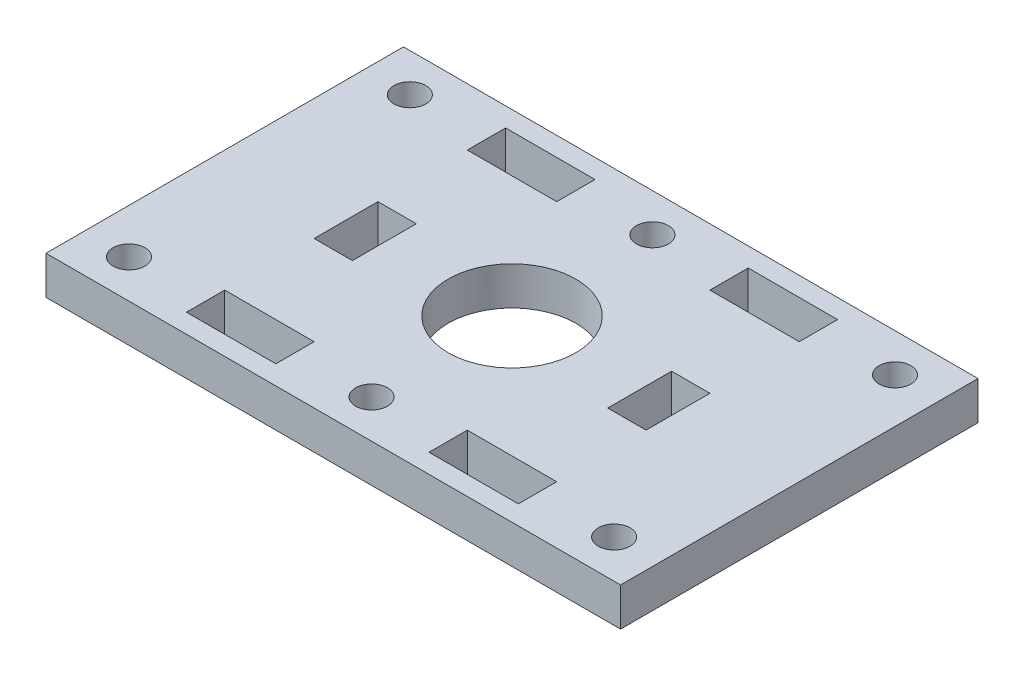
ISO-10303-21;
HEADER;
FILE_DESCRIPTION(('STEP AP214'),'2;1');
FILE_NAME('part.step','',(''),(''),'','','');
FILE_SCHEMA(('AUTOMOTIVE_DESIGN { 1 0 10303 214 1 1 1 1 }'));
ENDSEC;
DATA;
#1=APPLICATION_CONTEXT('core data for automotive mechanical design processes');
#2=APPLICATION_PROTOCOL_DEFINITION('international standard','automotive_design',2000,#1);
#3=PRODUCT_CONTEXT('',#1,'mechanical');
#4=PRODUCT('Part','Part','',(#3));
#5=PRODUCT_RELATED_PRODUCT_CATEGORY('part','',(#4));
#6=PRODUCT_DEFINITION_FORMATION('','',#4);
#7=PRODUCT_DEFINITION_CONTEXT('part definition',#1,'design');
#8=PRODUCT_DEFINITION('design','',#6,#7);
#9=PRODUCT_DEFINITION_SHAPE('','',#8);
#10=(LENGTH_UNIT() NAMED_UNIT(*) SI_UNIT(.MILLI.,.METRE.));
#11=(NAMED_UNIT(*) PLANE_ANGLE_UNIT() SI_UNIT($,.RADIAN.));
#12=(NAMED_UNIT(*) SI_UNIT($,.STERADIAN.) SOLID_ANGLE_UNIT());
#13=UNCERTAINTY_MEASURE_WITH_UNIT(LENGTH_MEASURE(1.E-05),#10,'distance_accuracy_value','');
#14=(GEOMETRIC_REPRESENTATION_CONTEXT(3) GLOBAL_UNCERTAINTY_ASSIGNED_CONTEXT((#13)) GLOBAL_UNIT_ASSIGNED_CONTEXT((#10,
#11,#12)) REPRESENTATION_CONTEXT('',''));
#15=CARTESIAN_POINT('',(0.,0.,0.));
#16=DIRECTION('',(0.,0.,1.));
#17=DIRECTION('',(1.,0.,0.));
#18=AXIS2_PLACEMENT_3D('',#15,#16,#17);
#19=CARTESIAN_POINT('',(0.,3.,0.));
#20=DIRECTION('',(1.,0.,0.));
#21=DIRECTION('',(0.,0.,-1.));
#22=AXIS2_PLACEMENT_3D('',#19,#20,#21);
#23=PLANE('',#22);
#24=DIRECTION('',(0.,0.,1.));
#25=VECTOR('',#24,1.);
#26=CARTESIAN_POINT('',(0.,0.,0.));
#27=LINE('',#26,#25);
#28=CARTESIAN_POINT('',(0.,0.,-28.));
#29=VERTEX_POINT('',#28);
#30=CARTESIAN_POINT('',(0.,0.,0.));
#31=VERTEX_POINT('',#30);
#32=EDGE_CURVE('E450',#29,#31,#27,.T.);
#33=ORIENTED_EDGE('',*,*,#32,.T.);
#34=DIRECTION('',(0.,-1.,0.));
#35=VECTOR('',#34,1.);
#36=CARTESIAN_POINT('',(0.,3.,0.));
#37=LINE('',#36,#35);
#38=CARTESIAN_POINT('',(0.,3.,0.));
#39=VERTEX_POINT('',#38);
#40=EDGE_CURVE('E11',#39,#31,#37,.T.);
#41=ORIENTED_EDGE('',*,*,#40,.F.);
#42=DIRECTION('',(0.,0.,1.));
#43=VECTOR('',#42,1.);
#44=CARTESIAN_POINT('',(0.,3.,0.));
#45=LINE('',#44,#43);
#46=CARTESIAN_POINT('',(0.,3.,-28.));
#47=VERTEX_POINT('',#46);
#48=EDGE_CURVE('E453',#47,#39,#45,.T.);
#49=ORIENTED_EDGE('',*,*,#48,.F.);
#50=DIRECTION('',(0.,-1.,0.));
#51=VECTOR('',#50,1.);
#52=CARTESIAN_POINT('',(0.,3.,-28.));
#53=LINE('',#52,#51);
#54=EDGE_CURVE('E463',#47,#29,#53,.T.);
#55=ORIENTED_EDGE('',*,*,#54,.T.);
#56=EDGE_LOOP('',(#33,#41,#49,#55));
#57=FACE_BOUND('',#56,.T.);
#58=ADVANCED_FACE('F32',(#57),#23,.F.);
#59=CARTESIAN_POINT('',(0.,3.,0.));
#60=DIRECTION('',(0.,0.,-1.));
#61=DIRECTION('',(-1.,0.,0.));
#62=AXIS2_PLACEMENT_3D('',#59,#60,#61);
#63=PLANE('',#62);
#64=DIRECTION('',(1.,0.,0.));
#65=VECTOR('',#64,1.);
#66=CARTESIAN_POINT('',(0.,0.,0.));
#67=LINE('',#66,#65);
#68=CARTESIAN_POINT('',(45.,0.,0.));
#69=VERTEX_POINT('',#68);
#70=EDGE_CURVE('E466',#31,#69,#67,.T.);
#71=ORIENTED_EDGE('',*,*,#70,.T.);
#72=DIRECTION('',(0.,-1.,0.));
#73=VECTOR('',#72,1.);
#74=CARTESIAN_POINT('',(45.,3.,0.));
#75=LINE('',#74,#73);
#76=CARTESIAN_POINT('',(45.,3.,0.));
#77=VERTEX_POINT('',#76);
#78=EDGE_CURVE('E40',#77,#69,#75,.T.);
#79=ORIENTED_EDGE('',*,*,#78,.F.);
#80=DIRECTION('',(1.,0.,0.));
#81=VECTOR('',#80,1.);
#82=CARTESIAN_POINT('',(0.,3.,0.));
#83=LINE('',#82,#81);
#84=EDGE_CURVE('E456',#39,#77,#83,.T.);
#85=ORIENTED_EDGE('',*,*,#84,.F.);
#86=ORIENTED_EDGE('',*,*,#40,.T.);
#87=EDGE_LOOP('',(#71,#79,#85,#86));
#88=FACE_BOUND('',#87,.T.);
#89=ADVANCED_FACE('F496',(#88),#63,.F.);
#90=CARTESIAN_POINT('',(45.,3.,0.));
#91=DIRECTION('',(-1.,0.,0.));
#92=DIRECTION('',(0.,0.,1.));
#93=AXIS2_PLACEMENT_3D('',#90,#91,#92);
#94=PLANE('',#93);
#95=DIRECTION('',(0.,0.,-1.));
#96=VECTOR('',#95,1.);
#97=CARTESIAN_POINT('',(45.,0.,0.));
#98=LINE('',#97,#96);
#99=CARTESIAN_POINT('',(45.,0.,-28.));
#100=VERTEX_POINT('',#99);
#101=EDGE_CURVE('E468',#69,#100,#98,.T.);
#102=ORIENTED_EDGE('',*,*,#101,.T.);
#103=DIRECTION('',(0.,-1.,0.));
#104=VECTOR('',#103,1.);
#105=CARTESIAN_POINT('',(45.,3.,-28.));
#106=LINE('',#105,#104);
#107=CARTESIAN_POINT('',(45.,3.,-28.));
#108=VERTEX_POINT('',#107);
#109=EDGE_CURVE('E473',#108,#100,#106,.T.);
#110=ORIENTED_EDGE('',*,*,#109,.F.);
#111=DIRECTION('',(0.,0.,-1.));
#112=VECTOR('',#111,1.);
#113=CARTESIAN_POINT('',(45.,3.,0.));
#114=LINE('',#113,#112);
#115=EDGE_CURVE('E459',#77,#108,#114,.T.);
#116=ORIENTED_EDGE('',*,*,#115,.F.);
#117=ORIENTED_EDGE('',*,*,#78,.T.);
#118=EDGE_LOOP('',(#102,#110,#116,#117));
#119=FACE_BOUND('',#118,.T.);
#120=ADVANCED_FACE('F481',(#119),#94,.F.);
#121=CARTESIAN_POINT('',(0.,3.,-28.));
#122=DIRECTION('',(0.,0.,1.));
#123=DIRECTION('',(1.,0.,0.));
#124=AXIS2_PLACEMENT_3D('',#121,#122,#123);
#125=PLANE('',#124);
#126=DIRECTION('',(-1.,0.,0.));
#127=VECTOR('',#126,1.);
#128=CARTESIAN_POINT('',(0.,0.,-28.));
#129=LINE('',#128,#127);
#130=EDGE_CURVE('E457',#100,#29,#129,.T.);
#131=ORIENTED_EDGE('',*,*,#130,.T.);
#132=ORIENTED_EDGE('',*,*,#54,.F.);
#133=DIRECTION('',(-1.,0.,0.));
#134=VECTOR('',#133,1.);
#135=CARTESIAN_POINT('',(0.,3.,-28.));
#136=LINE('',#135,#134);
#137=EDGE_CURVE('E461',#108,#47,#136,.T.);
#138=ORIENTED_EDGE('',*,*,#137,.F.);
#139=ORIENTED_EDGE('',*,*,#109,.T.);
#140=EDGE_LOOP('',(#131,#132,#138,#139));
#141=FACE_BOUND('',#140,.T.);
#142=ADVANCED_FACE('F489',(#141),#125,.F.);
#143=CARTESIAN_POINT('',(0.,3.,0.));
#144=DIRECTION('',(0.,-1.,0.));
#145=DIRECTION('',(0.,0.,-1.));
#146=AXIS2_PLACEMENT_3D('',#143,#144,#145);
#147=PLANE('',#146);
#148=CARTESIAN_POINT('',(22.5,3.,-14.));
#149=DIRECTION('',(0.,1.,0.));
#150=DIRECTION('',(0.,0.,1.));
#151=AXIS2_PLACEMENT_3D('',#148,#149,#150);
#152=CIRCLE('',#151,5.);
#153=CARTESIAN_POINT('',(22.5,3.,-9.));
#154=VERTEX_POINT('',#153);
#155=EDGE_CURVE('E244',#154,#154,#152,.T.);
#156=ORIENTED_EDGE('',*,*,#155,.F.);
#157=EDGE_LOOP('',(#156));
#158=FACE_BOUND('',#157,.T.);
#159=DIRECTION('',(1.,0.,0.));
#160=VECTOR('',#159,1.);
#161=CARTESIAN_POINT('',(9.49999999999999,3.,-11.5));
#162=LINE('',#161,#160);
#163=CARTESIAN_POINT('',(9.49999999999999,3.,-11.5));
#164=VERTEX_POINT('',#163);
#165=CARTESIAN_POINT('',(12.5,3.,-11.5));
#166=VERTEX_POINT('',#165);
#167=EDGE_CURVE('E249',#164,#166,#162,.T.);
#168=ORIENTED_EDGE('',*,*,#167,.F.);
#169=DIRECTION('',(0.,0.,1.));
#170=VECTOR('',#169,1.);
#171=CARTESIAN_POINT('',(9.49999999999999,3.,-11.5));
#172=LINE('',#171,#170);
#173=CARTESIAN_POINT('',(9.49999999999999,3.,-16.5));
#174=VERTEX_POINT('',#173);
#175=EDGE_CURVE('E47',#174,#164,#172,.T.);
#176=ORIENTED_EDGE('',*,*,#175,.F.);
#177=DIRECTION('',(-1.,0.,0.));
#178=VECTOR('',#177,1.);
#179=CARTESIAN_POINT('',(9.49999999999999,3.,-16.5));
#180=LINE('',#179,#178);
#181=CARTESIAN_POINT('',(12.5,3.,-16.5));
#182=VERTEX_POINT('',#181);
#183=EDGE_CURVE('E238',#182,#174,#180,.T.);
#184=ORIENTED_EDGE('',*,*,#183,.F.);
#185=DIRECTION('',(0.,0.,-1.));
#186=VECTOR('',#185,1.);
#187=CARTESIAN_POINT('',(12.5,3.,-11.5));
#188=LINE('',#187,#186);
#189=EDGE_CURVE('E241',#166,#182,#188,.T.);
#190=ORIENTED_EDGE('',*,*,#189,.F.);
#191=EDGE_LOOP('',(#168,#176,#184,#190));
#192=FACE_BOUND('',#191,.T.);
#193=DIRECTION('',(-1.,0.,0.));
#194=VECTOR('',#193,1.);
#195=CARTESIAN_POINT('',(35.5,3.,-16.5));
#196=LINE('',#195,#194);
#197=CARTESIAN_POINT('',(35.5,3.,-16.5));
#198=VERTEX_POINT('',#197);
#199=CARTESIAN_POINT('',(32.5,3.,-16.5));
#200=VERTEX_POINT('',#199);
#201=EDGE_CURVE('E275',#198,#200,#196,.T.);
#202=ORIENTED_EDGE('',*,*,#201,.F.);
#203=DIRECTION('',(0.,0.,-1.));
#204=VECTOR('',#203,1.);
#205=CARTESIAN_POINT('',(35.5,3.,-11.5));
#206=LINE('',#205,#204);
#207=CARTESIAN_POINT('',(35.5,3.,-11.5));
#208=VERTEX_POINT('',#207);
#209=EDGE_CURVE('E55',#208,#198,#206,.T.);
#210=ORIENTED_EDGE('',*,*,#209,.F.);
#211=DIRECTION('',(1.,0.,0.));
#212=VECTOR('',#211,1.);
#213=CARTESIAN_POINT('',(35.5,3.,-11.5));
#214=LINE('',#213,#212);
#215=CARTESIAN_POINT('',(32.5,3.,-11.5));
#216=VERTEX_POINT('',#215);
#217=EDGE_CURVE('E264',#216,#208,#214,.T.);
#218=ORIENTED_EDGE('',*,*,#217,.F.);
#219=DIRECTION('',(0.,0.,1.));
#220=VECTOR('',#219,1.);
#221=CARTESIAN_POINT('',(32.5,3.,-11.5));
#222=LINE('',#221,#220);
#223=EDGE_CURVE('E278',#200,#216,#222,.T.);
#224=ORIENTED_EDGE('',*,*,#223,.F.);
#225=EDGE_LOOP('',(#202,#210,#218,#224));
#226=FACE_BOUND('',#225,.T.);
#227=CARTESIAN_POINT('',(41.5,3.,-25.));
#228=DIRECTION('',(0.,1.,0.));
#229=DIRECTION('',(0.,0.,1.));
#230=AXIS2_PLACEMENT_3D('',#227,#228,#229);
#231=CIRCLE('',#230,1.25);
#232=CARTESIAN_POINT('',(41.5,3.,-23.75));
#233=VERTEX_POINT('',#232);
#234=EDGE_CURVE('E389',#233,#233,#231,.T.);
#235=ORIENTED_EDGE('',*,*,#234,.F.);
#236=EDGE_LOOP('',(#235));
#237=FACE_BOUND('',#236,.T.);
#238=CARTESIAN_POINT('',(3.49999999999999,3.,-25.));
#239=DIRECTION('',(0.,1.,0.));
#240=DIRECTION('',(0.,0.,-1.));
#241=AXIS2_PLACEMENT_3D('',#238,#239,#240);
#242=CIRCLE('',#241,1.25);
#243=CARTESIAN_POINT('',(3.49999999999999,3.,-26.25));
#244=VERTEX_POINT('',#243);
#245=EDGE_CURVE('E348',#244,#244,#242,.T.);
#246=ORIENTED_EDGE('',*,*,#245,.F.);
#247=EDGE_LOOP('',(#246));
#248=FACE_BOUND('',#247,.T.);
#249=DIRECTION('',(-1.,0.,0.));
#250=VECTOR('',#249,1.);
#251=CARTESIAN_POINT('',(35.5,3.,-4.5));
#252=LINE('',#251,#250);
#253=CARTESIAN_POINT('',(35.5,3.,-4.5));
#254=VERTEX_POINT('',#253);
#255=CARTESIAN_POINT('',(28.5,3.,-4.5));
#256=VERTEX_POINT('',#255);
#257=EDGE_CURVE('E337',#254,#256,#252,.T.);
#258=ORIENTED_EDGE('',*,*,#257,.F.);
#259=DIRECTION('',(0.,0.,-1.));
#260=VECTOR('',#259,1.);
#261=CARTESIAN_POINT('',(35.5,3.,-4.5));
#262=LINE('',#261,#260);
#263=CARTESIAN_POINT('',(35.5,3.,-1.5));
#264=VERTEX_POINT('',#263);
#265=EDGE_CURVE('E335',#264,#254,#262,.T.);
#266=ORIENTED_EDGE('',*,*,#265,.F.);
#267=DIRECTION('',(1.,0.,0.));
#268=VECTOR('',#267,1.);
#269=CARTESIAN_POINT('',(35.5,3.,-1.5));
#270=LINE('',#269,#268);
#271=CARTESIAN_POINT('',(28.5,3.,-1.5));
#272=VERTEX_POINT('',#271);
#273=EDGE_CURVE('E325',#272,#264,#270,.T.);
#274=ORIENTED_EDGE('',*,*,#273,.F.);
#275=DIRECTION('',(0.,0.,1.));
#276=VECTOR('',#275,1.);
#277=CARTESIAN_POINT('',(28.5,3.,-4.5));
#278=LINE('',#277,#276);
#279=EDGE_CURVE('E341',#256,#272,#278,.T.);
#280=ORIENTED_EDGE('',*,*,#279,.F.);
#281=EDGE_LOOP('',(#258,#266,#274,#280));
#282=FACE_BOUND('',#281,.T.);
#283=DIRECTION('',(0.,0.,-1.));
#284=VECTOR('',#283,1.);
#285=CARTESIAN_POINT('',(35.5,3.,-23.5));
#286=LINE('',#285,#284);
#287=CARTESIAN_POINT('',(35.5,3.,-23.5));
#288=VERTEX_POINT('',#287);
#289=CARTESIAN_POINT('',(35.5,3.,-26.5));
#290=VERTEX_POINT('',#289);
#291=EDGE_CURVE('E370',#288,#290,#286,.T.);
#292=ORIENTED_EDGE('',*,*,#291,.F.);
#293=DIRECTION('',(1.,0.,0.));
#294=VECTOR('',#293,1.);
#295=CARTESIAN_POINT('',(35.5,3.,-23.5));
#296=LINE('',#295,#294);
#297=CARTESIAN_POINT('',(28.5,3.,-23.5));
#298=VERTEX_POINT('',#297);
#299=EDGE_CURVE('E314',#298,#288,#296,.T.);
#300=ORIENTED_EDGE('',*,*,#299,.F.);
#301=DIRECTION('',(0.,0.,1.));
#302=VECTOR('',#301,1.);
#303=CARTESIAN_POINT('',(28.5,3.,-23.5));
#304=LINE('',#303,#302);
#305=CARTESIAN_POINT('',(28.5,3.,-26.5));
#306=VERTEX_POINT('',#305);
#307=EDGE_CURVE('E359',#306,#298,#304,.T.);
#308=ORIENTED_EDGE('',*,*,#307,.F.);
#309=DIRECTION('',(-1.,0.,0.));
#310=VECTOR('',#309,1.);
#311=CARTESIAN_POINT('',(35.5,3.,-26.5));
#312=LINE('',#311,#310);
#313=EDGE_CURVE('E373',#290,#306,#312,.T.);
#314=ORIENTED_EDGE('',*,*,#313,.F.);
#315=EDGE_LOOP('',(#292,#300,#308,#314));
#316=FACE_BOUND('',#315,.T.);
#317=CARTESIAN_POINT('',(22.5,3.,-25.));
#318=DIRECTION('',(0.,1.,0.));
#319=DIRECTION('',(0.,0.,-1.));
#320=AXIS2_PLACEMENT_3D('',#317,#318,#319);
#321=CIRCLE('',#320,1.25);
#322=CARTESIAN_POINT('',(22.5,3.,-26.25));
#323=VERTEX_POINT('',#322);
#324=EDGE_CURVE('E439',#323,#323,#321,.T.);
#325=ORIENTED_EDGE('',*,*,#324,.F.);
#326=EDGE_LOOP('',(#325));
#327=FACE_BOUND('',#326,.T.);
#328=CARTESIAN_POINT('',(3.5,3.,-3.));
#329=DIRECTION('',(0.,1.,0.));
#330=DIRECTION('',(0.,0.,1.));
#331=AXIS2_PLACEMENT_3D('',#328,#329,#330);
#332=CIRCLE('',#331,1.25);
#333=CARTESIAN_POINT('',(3.5,3.,-1.75));
#334=VERTEX_POINT('',#333);
#335=EDGE_CURVE('E400',#334,#334,#332,.T.);
#336=ORIENTED_EDGE('',*,*,#335,.F.);
#337=EDGE_LOOP('',(#336));
#338=FACE_BOUND('',#337,.T.);
#339=CARTESIAN_POINT('',(41.5,3.,-3.00000000000001));
#340=DIRECTION('',(0.,1.,0.));
#341=DIRECTION('',(0.,0.,-1.));
#342=AXIS2_PLACEMENT_3D('',#339,#340,#341);
#343=CIRCLE('',#342,1.25);
#344=CARTESIAN_POINT('',(41.5,3.,-4.25));
#345=VERTEX_POINT('',#344);
#346=EDGE_CURVE('E401',#345,#345,#343,.T.);
#347=ORIENTED_EDGE('',*,*,#346,.F.);
#348=EDGE_LOOP('',(#347));
#349=FACE_BOUND('',#348,.T.);
#350=DIRECTION('',(1.,0.,0.));
#351=VECTOR('',#350,1.);
#352=CARTESIAN_POINT('',(9.5,3.,-1.5));
#353=LINE('',#352,#351);
#354=CARTESIAN_POINT('',(9.5,3.,-1.5));
#355=VERTEX_POINT('',#354);
#356=CARTESIAN_POINT('',(16.5,3.,-1.5));
#357=VERTEX_POINT('',#356);
#358=EDGE_CURVE('E420',#355,#357,#353,.T.);
#359=ORIENTED_EDGE('',*,*,#358,.F.);
#360=DIRECTION('',(0.,0.,1.));
#361=VECTOR('',#360,1.);
#362=CARTESIAN_POINT('',(9.5,3.,-4.5));
#363=LINE('',#362,#361);
#364=CARTESIAN_POINT('',(9.5,3.,-4.5));
#365=VERTEX_POINT('',#364);
#366=EDGE_CURVE('E388',#365,#355,#363,.T.);
#367=ORIENTED_EDGE('',*,*,#366,.F.);
#368=DIRECTION('',(-1.,0.,0.));
#369=VECTOR('',#368,1.);
#370=CARTESIAN_POINT('',(9.5,3.,-4.5));
#371=LINE('',#370,#369);
#372=CARTESIAN_POINT('',(16.5,3.,-4.5));
#373=VERTEX_POINT('',#372);
#374=EDGE_CURVE('E409',#373,#365,#371,.T.);
#375=ORIENTED_EDGE('',*,*,#374,.F.);
#376=DIRECTION('',(0.,0.,-1.));
#377=VECTOR('',#376,1.);
#378=CARTESIAN_POINT('',(16.5,3.,-4.5));
#379=LINE('',#378,#377);
#380=EDGE_CURVE('E423',#357,#373,#379,.T.);
#381=ORIENTED_EDGE('',*,*,#380,.F.);
#382=EDGE_LOOP('',(#359,#367,#375,#381));
#383=FACE_BOUND('',#382,.T.);
#384=DIRECTION('',(1.,0.,0.));
#385=VECTOR('',#384,1.);
#386=CARTESIAN_POINT('',(9.49999999999999,3.,-23.5));
#387=LINE('',#386,#385);
#388=CARTESIAN_POINT('',(9.49999999999999,3.,-23.5));
#389=VERTEX_POINT('',#388);
#390=CARTESIAN_POINT('',(16.5,3.,-23.5));
#391=VERTEX_POINT('',#390);
#392=EDGE_CURVE('E304',#389,#391,#387,.T.);
#393=ORIENTED_EDGE('',*,*,#392,.F.);
#394=DIRECTION('',(0.,0.,1.));
#395=VECTOR('',#394,1.);
#396=CARTESIAN_POINT('',(9.49999999999999,3.,-23.5));
#397=LINE('',#396,#395);
#398=CARTESIAN_POINT('',(9.49999999999999,3.,-26.5));
#399=VERTEX_POINT('',#398);
#400=EDGE_CURVE('E256',#399,#389,#397,.T.);
#401=ORIENTED_EDGE('',*,*,#400,.F.);
#402=DIRECTION('',(-1.,0.,0.));
#403=VECTOR('',#402,1.);
#404=CARTESIAN_POINT('',(9.49999999999999,3.,-26.5));
#405=LINE('',#404,#403);
#406=CARTESIAN_POINT('',(16.5,3.,-26.5));
#407=VERTEX_POINT('',#406);
#408=EDGE_CURVE('E293',#407,#399,#405,.T.);
#409=ORIENTED_EDGE('',*,*,#408,.F.);
#410=DIRECTION('',(0.,0.,-1.));
#411=VECTOR('',#410,1.);
#412=CARTESIAN_POINT('',(16.5,3.,-23.5));
#413=LINE('',#412,#411);
#414=EDGE_CURVE('E307',#391,#407,#413,.T.);
#415=ORIENTED_EDGE('',*,*,#414,.F.);
#416=EDGE_LOOP('',(#393,#401,#409,#415));
#417=FACE_BOUND('',#416,.T.);
#418=CARTESIAN_POINT('',(22.5,3.,-3.00000000000001));
#419=DIRECTION('',(0.,1.,0.));
#420=DIRECTION('',(0.,0.,1.));
#421=AXIS2_PLACEMENT_3D('',#418,#419,#420);
#422=CIRCLE('',#421,1.25);
#423=CARTESIAN_POINT('',(22.5,3.,-1.75000000000001));
#424=VERTEX_POINT('',#423);
#425=EDGE_CURVE('E438',#424,#424,#422,.T.);
#426=ORIENTED_EDGE('',*,*,#425,.F.);
#427=EDGE_LOOP('',(#426));
#428=FACE_BOUND('',#427,.T.);
#429=ORIENTED_EDGE('',*,*,#48,.T.);
#430=ORIENTED_EDGE('',*,*,#84,.T.);
#431=ORIENTED_EDGE('',*,*,#115,.T.);
#432=ORIENTED_EDGE('',*,*,#137,.T.);
#433=EDGE_LOOP('',(#429,#430,#431,#432));
#434=FACE_BOUND('',#433,.T.);
#435=ADVANCED_FACE('F495',(#158,#192,#226,#237,#248,#282,#316,#327,#338,#349,#383,#417,#428,
#434),#147,.F.);
#436=CARTESIAN_POINT('',(0.,0.,0.));
#437=DIRECTION('',(0.,-1.,0.));
#438=DIRECTION('',(0.,0.,-1.));
#439=AXIS2_PLACEMENT_3D('',#436,#437,#438);
#440=PLANE('',#439);
#441=CARTESIAN_POINT('',(22.5,0.,-14.));
#442=DIRECTION('',(0.,-1.,0.));
#443=DIRECTION('',(0.,0.,-1.));
#444=AXIS2_PLACEMENT_3D('',#441,#442,#443);
#445=CIRCLE('',#444,5.);
#446=CARTESIAN_POINT('',(22.5,0.,-19.));
#447=VERTEX_POINT('',#446);
#448=EDGE_CURVE('E35',#447,#447,#445,.T.);
#449=ORIENTED_EDGE('',*,*,#448,.F.);
#450=EDGE_LOOP('',(#449));
#451=FACE_BOUND('',#450,.T.);
#452=DIRECTION('',(0.,0.,1.));
#453=VECTOR('',#452,1.);
#454=CARTESIAN_POINT('',(9.49999999999999,0.,-11.5));
#455=LINE('',#454,#453);
#456=CARTESIAN_POINT('',(9.49999999999999,0.,-16.5));
#457=VERTEX_POINT('',#456);
#458=CARTESIAN_POINT('',(9.49999999999999,0.,-11.5));
#459=VERTEX_POINT('',#458);
#460=EDGE_CURVE('E219',#457,#459,#455,.T.);
#461=ORIENTED_EDGE('',*,*,#460,.T.);
#462=DIRECTION('',(1.,0.,0.));
#463=VECTOR('',#462,1.);
#464=CARTESIAN_POINT('',(9.49999999999999,0.,-11.5));
#465=LINE('',#464,#463);
#466=CARTESIAN_POINT('',(12.5,0.,-11.5));
#467=VERTEX_POINT('',#466);
#468=EDGE_CURVE('E229',#459,#467,#465,.T.);
#469=ORIENTED_EDGE('',*,*,#468,.T.);
#470=DIRECTION('',(0.,0.,-1.));
#471=VECTOR('',#470,1.);
#472=CARTESIAN_POINT('',(12.5,0.,-11.5));
#473=LINE('',#472,#471);
#474=CARTESIAN_POINT('',(12.5,0.,-16.5));
#475=VERTEX_POINT('',#474);
#476=EDGE_CURVE('E233',#467,#475,#473,.T.);
#477=ORIENTED_EDGE('',*,*,#476,.T.);
#478=DIRECTION('',(-1.,0.,0.));
#479=VECTOR('',#478,1.);
#480=CARTESIAN_POINT('',(9.49999999999999,0.,-16.5));
#481=LINE('',#480,#479);
#482=EDGE_CURVE('E225',#475,#457,#481,.T.);
#483=ORIENTED_EDGE('',*,*,#482,.T.);
#484=EDGE_LOOP('',(#461,#469,#477,#483));
#485=FACE_BOUND('',#484,.T.);
#486=DIRECTION('',(0.,0.,-1.));
#487=VECTOR('',#486,1.);
#488=CARTESIAN_POINT('',(35.5,0.,-11.5));
#489=LINE('',#488,#487);
#490=CARTESIAN_POINT('',(35.5,0.,-11.5));
#491=VERTEX_POINT('',#490);
#492=CARTESIAN_POINT('',(35.5,0.,-16.5));
#493=VERTEX_POINT('',#492);
#494=EDGE_CURVE('E260',#491,#493,#489,.T.);
#495=ORIENTED_EDGE('',*,*,#494,.T.);
#496=DIRECTION('',(-1.,0.,0.));
#497=VECTOR('',#496,1.);
#498=CARTESIAN_POINT('',(35.5,0.,-16.5));
#499=LINE('',#498,#497);
#500=CARTESIAN_POINT('',(32.5,0.,-16.5));
#501=VERTEX_POINT('',#500);
#502=EDGE_CURVE('E263',#493,#501,#499,.T.);
#503=ORIENTED_EDGE('',*,*,#502,.T.);
#504=DIRECTION('',(0.,0.,1.));
#505=VECTOR('',#504,1.);
#506=CARTESIAN_POINT('',(32.5,0.,-11.5));
#507=LINE('',#506,#505);
#508=CARTESIAN_POINT('',(32.5,0.,-11.5));
#509=VERTEX_POINT('',#508);
#510=EDGE_CURVE('E267',#501,#509,#507,.T.);
#511=ORIENTED_EDGE('',*,*,#510,.T.);
#512=DIRECTION('',(1.,0.,0.));
#513=VECTOR('',#512,1.);
#514=CARTESIAN_POINT('',(35.5,0.,-11.5));
#515=LINE('',#514,#513);
#516=EDGE_CURVE('E270',#509,#491,#515,.T.);
#517=ORIENTED_EDGE('',*,*,#516,.T.);
#518=EDGE_LOOP('',(#495,#503,#511,#517));
#519=FACE_BOUND('',#518,.T.);
#520=CARTESIAN_POINT('',(41.5,0.,-25.));
#521=DIRECTION('',(0.,1.,0.));
#522=DIRECTION('',(0.,0.,1.));
#523=AXIS2_PLACEMENT_3D('',#520,#521,#522);
#524=CIRCLE('',#523,1.25);
#525=CARTESIAN_POINT('',(41.5,0.,-23.75));
#526=VERTEX_POINT('',#525);
#527=EDGE_CURVE('E385',#526,#526,#524,.T.);
#528=ORIENTED_EDGE('',*,*,#527,.T.);
#529=EDGE_LOOP('',(#528));
#530=FACE_BOUND('',#529,.T.);
#531=CARTESIAN_POINT('',(3.49999999999999,0.,-25.));
#532=DIRECTION('',(0.,1.,0.));
#533=DIRECTION('',(0.,0.,-1.));
#534=AXIS2_PLACEMENT_3D('',#531,#532,#533);
#535=CIRCLE('',#534,1.25);
#536=CARTESIAN_POINT('',(3.49999999999999,0.,-26.25));
#537=VERTEX_POINT('',#536);
#538=EDGE_CURVE('E392',#537,#537,#535,.T.);
#539=ORIENTED_EDGE('',*,*,#538,.T.);
#540=EDGE_LOOP('',(#539));
#541=FACE_BOUND('',#540,.T.);
#542=DIRECTION('',(0.,0.,-1.));
#543=VECTOR('',#542,1.);
#544=CARTESIAN_POINT('',(35.5,0.,-4.5));
#545=LINE('',#544,#543);
#546=CARTESIAN_POINT('',(35.5,0.,-1.5));
#547=VERTEX_POINT('',#546);
#548=CARTESIAN_POINT('',(35.5,0.,-4.5));
#549=VERTEX_POINT('',#548);
#550=EDGE_CURVE('E321',#547,#549,#545,.T.);
#551=ORIENTED_EDGE('',*,*,#550,.T.);
#552=DIRECTION('',(-1.,0.,0.));
#553=VECTOR('',#552,1.);
#554=CARTESIAN_POINT('',(35.5,0.,-4.5));
#555=LINE('',#554,#553);
#556=CARTESIAN_POINT('',(28.5,0.,-4.5));
#557=VERTEX_POINT('',#556);
#558=EDGE_CURVE('E324',#549,#557,#555,.T.);
#559=ORIENTED_EDGE('',*,*,#558,.T.);
#560=DIRECTION('',(0.,0.,1.));
#561=VECTOR('',#560,1.);
#562=CARTESIAN_POINT('',(28.5,0.,-4.5));
#563=LINE('',#562,#561);
#564=CARTESIAN_POINT('',(28.5,0.,-1.5));
#565=VERTEX_POINT('',#564);
#566=EDGE_CURVE('E328',#557,#565,#563,.T.);
#567=ORIENTED_EDGE('',*,*,#566,.T.);
#568=DIRECTION('',(1.,0.,0.));
#569=VECTOR('',#568,1.);
#570=CARTESIAN_POINT('',(35.5,0.,-1.5));
#571=LINE('',#570,#569);
#572=EDGE_CURVE('E331',#565,#547,#571,.T.);
#573=ORIENTED_EDGE('',*,*,#572,.T.);
#574=EDGE_LOOP('',(#551,#559,#567,#573));
#575=FACE_BOUND('',#574,.T.);
#576=DIRECTION('',(1.,0.,0.));
#577=VECTOR('',#576,1.);
#578=CARTESIAN_POINT('',(35.5,0.,-23.5));
#579=LINE('',#578,#577);
#580=CARTESIAN_POINT('',(28.5,0.,-23.5));
#581=VERTEX_POINT('',#580);
#582=CARTESIAN_POINT('',(35.5,0.,-23.5));
#583=VERTEX_POINT('',#582);
#584=EDGE_CURVE('E355',#581,#583,#579,.T.);
#585=ORIENTED_EDGE('',*,*,#584,.T.);
#586=DIRECTION('',(0.,0.,-1.));
#587=VECTOR('',#586,1.);
#588=CARTESIAN_POINT('',(35.5,0.,-23.5));
#589=LINE('',#588,#587);
#590=CARTESIAN_POINT('',(35.5,0.,-26.5));
#591=VERTEX_POINT('',#590);
#592=EDGE_CURVE('E358',#583,#591,#589,.T.);
#593=ORIENTED_EDGE('',*,*,#592,.T.);
#594=DIRECTION('',(-1.,0.,0.));
#595=VECTOR('',#594,1.);
#596=CARTESIAN_POINT('',(35.5,0.,-26.5));
#597=LINE('',#596,#595);
#598=CARTESIAN_POINT('',(28.5,0.,-26.5));
#599=VERTEX_POINT('',#598);
#600=EDGE_CURVE('E362',#591,#599,#597,.T.);
#601=ORIENTED_EDGE('',*,*,#600,.T.);
#602=DIRECTION('',(0.,0.,1.));
#603=VECTOR('',#602,1.);
#604=CARTESIAN_POINT('',(28.5,0.,-23.5));
#605=LINE('',#604,#603);
#606=EDGE_CURVE('E365',#599,#581,#605,.T.);
#607=ORIENTED_EDGE('',*,*,#606,.T.);
#608=EDGE_LOOP('',(#585,#593,#601,#607));
#609=FACE_BOUND('',#608,.T.);
#610=CARTESIAN_POINT('',(22.5,0.,-25.));
#611=DIRECTION('',(0.,1.,0.));
#612=DIRECTION('',(0.,0.,-1.));
#613=AXIS2_PLACEMENT_3D('',#610,#611,#612);
#614=CIRCLE('',#613,1.25);
#615=CARTESIAN_POINT('',(22.5,0.,-26.25));
#616=VERTEX_POINT('',#615);
#617=EDGE_CURVE('E435',#616,#616,#614,.T.);
#618=ORIENTED_EDGE('',*,*,#617,.T.);
#619=EDGE_LOOP('',(#618));
#620=FACE_BOUND('',#619,.T.);
#621=CARTESIAN_POINT('',(3.5,0.,-3.));
#622=DIRECTION('',(0.,1.,0.));
#623=DIRECTION('',(0.,0.,1.));
#624=AXIS2_PLACEMENT_3D('',#621,#622,#623);
#625=CIRCLE('',#624,1.25);
#626=CARTESIAN_POINT('',(3.5,0.,-1.75));
#627=VERTEX_POINT('',#626);
#628=EDGE_CURVE('E442',#627,#627,#625,.T.);
#629=ORIENTED_EDGE('',*,*,#628,.T.);
#630=EDGE_LOOP('',(#629));
#631=FACE_BOUND('',#630,.T.);
#632=CARTESIAN_POINT('',(41.5,0.,-3.00000000000001));
#633=DIRECTION('',(0.,1.,0.));
#634=DIRECTION('',(0.,0.,-1.));
#635=AXIS2_PLACEMENT_3D('',#632,#633,#634);
#636=CIRCLE('',#635,1.25);
#637=CARTESIAN_POINT('',(41.5,0.,-4.25));
#638=VERTEX_POINT('',#637);
#639=EDGE_CURVE('E397',#638,#638,#636,.T.);
#640=ORIENTED_EDGE('',*,*,#639,.T.);
#641=EDGE_LOOP('',(#640));
#642=FACE_BOUND('',#641,.T.);
#643=DIRECTION('',(0.,0.,1.));
#644=VECTOR('',#643,1.);
#645=CARTESIAN_POINT('',(9.5,0.,-4.5));
#646=LINE('',#645,#644);
#647=CARTESIAN_POINT('',(9.5,0.,-4.5));
#648=VERTEX_POINT('',#647);
#649=CARTESIAN_POINT('',(9.5,0.,-1.5));
#650=VERTEX_POINT('',#649);
#651=EDGE_CURVE('E405',#648,#650,#646,.T.);
#652=ORIENTED_EDGE('',*,*,#651,.T.);
#653=DIRECTION('',(1.,0.,0.));
#654=VECTOR('',#653,1.);
#655=CARTESIAN_POINT('',(9.5,0.,-1.5));
#656=LINE('',#655,#654);
#657=CARTESIAN_POINT('',(16.5,0.,-1.5));
#658=VERTEX_POINT('',#657);
#659=EDGE_CURVE('E408',#650,#658,#656,.T.);
#660=ORIENTED_EDGE('',*,*,#659,.T.);
#661=DIRECTION('',(0.,0.,-1.));
#662=VECTOR('',#661,1.);
#663=CARTESIAN_POINT('',(16.5,0.,-4.5));
#664=LINE('',#663,#662);
#665=CARTESIAN_POINT('',(16.5,0.,-4.5));
#666=VERTEX_POINT('',#665);
#667=EDGE_CURVE('E412',#658,#666,#664,.T.);
#668=ORIENTED_EDGE('',*,*,#667,.T.);
#669=DIRECTION('',(-1.,0.,0.));
#670=VECTOR('',#669,1.);
#671=CARTESIAN_POINT('',(9.5,0.,-4.5));
#672=LINE('',#671,#670);
#673=EDGE_CURVE('E415',#666,#648,#672,.T.);
#674=ORIENTED_EDGE('',*,*,#673,.T.);
#675=EDGE_LOOP('',(#652,#660,#668,#674));
#676=FACE_BOUND('',#675,.T.);
#677=DIRECTION('',(0.,0.,1.));
#678=VECTOR('',#677,1.);
#679=CARTESIAN_POINT('',(9.49999999999999,0.,-23.5));
#680=LINE('',#679,#678);
#681=CARTESIAN_POINT('',(9.49999999999999,0.,-26.5));
#682=VERTEX_POINT('',#681);
#683=CARTESIAN_POINT('',(9.49999999999999,0.,-23.5));
#684=VERTEX_POINT('',#683);
#685=EDGE_CURVE('E289',#682,#684,#680,.T.);
#686=ORIENTED_EDGE('',*,*,#685,.T.);
#687=DIRECTION('',(1.,0.,0.));
#688=VECTOR('',#687,1.);
#689=CARTESIAN_POINT('',(9.49999999999999,0.,-23.5));
#690=LINE('',#689,#688);
#691=CARTESIAN_POINT('',(16.5,0.,-23.5));
#692=VERTEX_POINT('',#691);
#693=EDGE_CURVE('E292',#684,#692,#690,.T.);
#694=ORIENTED_EDGE('',*,*,#693,.T.);
#695=DIRECTION('',(0.,0.,-1.));
#696=VECTOR('',#695,1.);
#697=CARTESIAN_POINT('',(16.5,0.,-23.5));
#698=LINE('',#697,#696);
#699=CARTESIAN_POINT('',(16.5,0.,-26.5));
#700=VERTEX_POINT('',#699);
#701=EDGE_CURVE('E296',#692,#700,#698,.T.);
#702=ORIENTED_EDGE('',*,*,#701,.T.);
#703=DIRECTION('',(-1.,0.,0.));
#704=VECTOR('',#703,1.);
#705=CARTESIAN_POINT('',(9.49999999999999,0.,-26.5));
#706=LINE('',#705,#704);
#707=EDGE_CURVE('E299',#700,#682,#706,.T.);
#708=ORIENTED_EDGE('',*,*,#707,.T.);
#709=EDGE_LOOP('',(#686,#694,#702,#708));
#710=FACE_BOUND('',#709,.T.);
#711=CARTESIAN_POINT('',(22.5,0.,-3.00000000000001));
#712=DIRECTION('',(0.,1.,0.));
#713=DIRECTION('',(0.,0.,1.));
#714=AXIS2_PLACEMENT_3D('',#711,#712,#713);
#715=CIRCLE('',#714,1.25);
#716=CARTESIAN_POINT('',(22.5,0.,-1.75000000000001));
#717=VERTEX_POINT('',#716);
#718=EDGE_CURVE('E447',#717,#717,#715,.T.);
#719=ORIENTED_EDGE('',*,*,#718,.T.);
#720=EDGE_LOOP('',(#719));
#721=FACE_BOUND('',#720,.T.);
#722=ORIENTED_EDGE('',*,*,#32,.F.);
#723=ORIENTED_EDGE('',*,*,#130,.F.);
#724=ORIENTED_EDGE('',*,*,#101,.F.);
#725=ORIENTED_EDGE('',*,*,#70,.F.);
#726=EDGE_LOOP('',(#722,#723,#724,#725));
#727=FACE_BOUND('',#726,.T.);
#728=ADVANCED_FACE('F235',(#451,#485,#519,#530,#541,#575,#609,#620,#631,#642,#676,#710,#721,
#727),#440,.T.);
#729=CARTESIAN_POINT('',(22.5,0.,-3.00000000000001));
#730=DIRECTION('',(0.,1.,0.));
#731=DIRECTION('',(0.,0.,1.));
#732=AXIS2_PLACEMENT_3D('',#729,#730,#731);
#733=CYLINDRICAL_SURFACE('',#732,1.25);
#734=ORIENTED_EDGE('',*,*,#718,.F.);
#735=EDGE_LOOP('',(#734));
#736=FACE_BOUND('',#735,.T.);
#737=ORIENTED_EDGE('',*,*,#425,.T.);
#738=EDGE_LOOP('',(#737));
#739=FACE_BOUND('',#738,.T.);
#740=ADVANCED_FACE('F508',(#736,#739),#733,.F.);
#741=CARTESIAN_POINT('',(9.49999999999999,0.,-23.5));
#742=DIRECTION('',(-1.,0.,0.));
#743=DIRECTION('',(0.,0.,1.));
#744=AXIS2_PLACEMENT_3D('',#741,#742,#743);
#745=PLANE('',#744);
#746=ORIENTED_EDGE('',*,*,#400,.T.);
#747=DIRECTION('',(0.,1.,0.));
#748=VECTOR('',#747,1.);
#749=CARTESIAN_POINT('',(9.49999999999999,0.,-23.5));
#750=LINE('',#749,#748);
#751=EDGE_CURVE('E302',#684,#389,#750,.T.);
#752=ORIENTED_EDGE('',*,*,#751,.F.);
#753=ORIENTED_EDGE('',*,*,#685,.F.);
#754=DIRECTION('',(0.,1.,0.));
#755=VECTOR('',#754,1.);
#756=CARTESIAN_POINT('',(9.49999999999999,0.,-26.5));
#757=LINE('',#756,#755);
#758=EDGE_CURVE('E312',#682,#399,#757,.T.);
#759=ORIENTED_EDGE('',*,*,#758,.T.);
#760=EDGE_LOOP('',(#746,#752,#753,#759));
#761=FACE_BOUND('',#760,.T.);
#762=ADVANCED_FACE('F515',(#761),#745,.F.);
#763=CARTESIAN_POINT('',(9.49999999999999,0.,-26.5));
#764=DIRECTION('',(0.,0.,-1.));
#765=DIRECTION('',(-1.,0.,0.));
#766=AXIS2_PLACEMENT_3D('',#763,#764,#765);
#767=PLANE('',#766);
#768=ORIENTED_EDGE('',*,*,#408,.T.);
#769=ORIENTED_EDGE('',*,*,#758,.F.);
#770=ORIENTED_EDGE('',*,*,#707,.F.);
#771=DIRECTION('',(0.,1.,0.));
#772=VECTOR('',#771,1.);
#773=CARTESIAN_POINT('',(16.5,0.,-26.5));
#774=LINE('',#773,#772);
#775=EDGE_CURVE('E315',#700,#407,#774,.T.);
#776=ORIENTED_EDGE('',*,*,#775,.T.);
#777=EDGE_LOOP('',(#768,#769,#770,#776));
#778=FACE_BOUND('',#777,.T.);
#779=ADVANCED_FACE('F589',(#778),#767,.F.);
#780=CARTESIAN_POINT('',(16.5,0.,-23.5));
#781=DIRECTION('',(1.,0.,0.));
#782=DIRECTION('',(0.,0.,-1.));
#783=AXIS2_PLACEMENT_3D('',#780,#781,#782);
#784=PLANE('',#783);
#785=ORIENTED_EDGE('',*,*,#414,.T.);
#786=ORIENTED_EDGE('',*,*,#775,.F.);
#787=ORIENTED_EDGE('',*,*,#701,.F.);
#788=DIRECTION('',(0.,1.,0.));
#789=VECTOR('',#788,1.);
#790=CARTESIAN_POINT('',(16.5,0.,-23.5));
#791=LINE('',#790,#789);
#792=EDGE_CURVE('E317',#692,#391,#791,.T.);
#793=ORIENTED_EDGE('',*,*,#792,.T.);
#794=EDGE_LOOP('',(#785,#786,#787,#793));
#795=FACE_BOUND('',#794,.T.);
#796=ADVANCED_FACE('F593',(#795),#784,.F.);
#797=CARTESIAN_POINT('',(9.49999999999999,0.,-23.5));
#798=DIRECTION('',(0.,0.,1.));
#799=DIRECTION('',(1.,0.,0.));
#800=AXIS2_PLACEMENT_3D('',#797,#798,#799);
#801=PLANE('',#800);
#802=ORIENTED_EDGE('',*,*,#392,.T.);
#803=ORIENTED_EDGE('',*,*,#792,.F.);
#804=ORIENTED_EDGE('',*,*,#693,.F.);
#805=ORIENTED_EDGE('',*,*,#751,.T.);
#806=EDGE_LOOP('',(#802,#803,#804,#805));
#807=FACE_BOUND('',#806,.T.);
#808=ADVANCED_FACE('F531',(#807),#801,.F.);
#809=CARTESIAN_POINT('',(9.5,0.,-4.5));
#810=DIRECTION('',(-1.,0.,0.));
#811=DIRECTION('',(0.,0.,1.));
#812=AXIS2_PLACEMENT_3D('',#809,#810,#811);
#813=PLANE('',#812);
#814=ORIENTED_EDGE('',*,*,#366,.T.);
#815=DIRECTION('',(0.,1.,0.));
#816=VECTOR('',#815,1.);
#817=CARTESIAN_POINT('',(9.5,0.,-1.5));
#818=LINE('',#817,#816);
#819=EDGE_CURVE('E418',#650,#355,#818,.T.);
#820=ORIENTED_EDGE('',*,*,#819,.F.);
#821=ORIENTED_EDGE('',*,*,#651,.F.);
#822=DIRECTION('',(0.,1.,0.));
#823=VECTOR('',#822,1.);
#824=CARTESIAN_POINT('',(9.5,0.,-4.5));
#825=LINE('',#824,#823);
#826=EDGE_CURVE('E404',#648,#365,#825,.T.);
#827=ORIENTED_EDGE('',*,*,#826,.T.);
#828=EDGE_LOOP('',(#814,#820,#821,#827));
#829=FACE_BOUND('',#828,.T.);
#830=ADVANCED_FACE('F527',(#829),#813,.F.);
#831=CARTESIAN_POINT('',(9.5,0.,-4.5));
#832=DIRECTION('',(0.,0.,-1.));
#833=DIRECTION('',(-1.,0.,0.));
#834=AXIS2_PLACEMENT_3D('',#831,#832,#833);
#835=PLANE('',#834);
#836=ORIENTED_EDGE('',*,*,#374,.T.);
#837=ORIENTED_EDGE('',*,*,#826,.F.);
#838=ORIENTED_EDGE('',*,*,#673,.F.);
#839=DIRECTION('',(0.,1.,0.));
#840=VECTOR('',#839,1.);
#841=CARTESIAN_POINT('',(16.5,0.,-4.5));
#842=LINE('',#841,#840);
#843=EDGE_CURVE('E429',#666,#373,#842,.T.);
#844=ORIENTED_EDGE('',*,*,#843,.T.);
#845=EDGE_LOOP('',(#836,#837,#838,#844));
#846=FACE_BOUND('',#845,.T.);
#847=ADVANCED_FACE('F530',(#846),#835,.F.);
#848=CARTESIAN_POINT('',(16.5,0.,-4.5));
#849=DIRECTION('',(1.,0.,0.));
#850=DIRECTION('',(0.,0.,-1.));
#851=AXIS2_PLACEMENT_3D('',#848,#849,#850);
#852=PLANE('',#851);
#853=ORIENTED_EDGE('',*,*,#380,.T.);
#854=ORIENTED_EDGE('',*,*,#843,.F.);
#855=ORIENTED_EDGE('',*,*,#667,.F.);
#856=DIRECTION('',(0.,1.,0.));
#857=VECTOR('',#856,1.);
#858=CARTESIAN_POINT('',(16.5,0.,-1.5));
#859=LINE('',#858,#857);
#860=EDGE_CURVE('E431',#658,#357,#859,.T.);
#861=ORIENTED_EDGE('',*,*,#860,.T.);
#862=EDGE_LOOP('',(#853,#854,#855,#861));
#863=FACE_BOUND('',#862,.T.);
#864=ADVANCED_FACE('F536',(#863),#852,.F.);
#865=CARTESIAN_POINT('',(9.5,0.,-1.5));
#866=DIRECTION('',(0.,0.,1.));
#867=DIRECTION('',(1.,0.,0.));
#868=AXIS2_PLACEMENT_3D('',#865,#866,#867);
#869=PLANE('',#868);
#870=ORIENTED_EDGE('',*,*,#358,.T.);
#871=ORIENTED_EDGE('',*,*,#860,.F.);
#872=ORIENTED_EDGE('',*,*,#659,.F.);
#873=ORIENTED_EDGE('',*,*,#819,.T.);
#874=EDGE_LOOP('',(#870,#871,#872,#873));
#875=FACE_BOUND('',#874,.T.);
#876=ADVANCED_FACE('F533',(#875),#869,.F.);
#877=CARTESIAN_POINT('',(41.5,0.,-3.00000000000001));
#878=DIRECTION('',(0.,1.,0.));
#879=DIRECTION('',(0.,0.,1.));
#880=AXIS2_PLACEMENT_3D('',#877,#878,#879);
#881=CYLINDRICAL_SURFACE('',#880,1.25);
#882=ORIENTED_EDGE('',*,*,#639,.F.);
#883=EDGE_LOOP('',(#882));
#884=FACE_BOUND('',#883,.T.);
#885=ORIENTED_EDGE('',*,*,#346,.T.);
#886=EDGE_LOOP('',(#885));
#887=FACE_BOUND('',#886,.T.);
#888=ADVANCED_FACE('F521',(#884,#887),#881,.F.);
#889=CARTESIAN_POINT('',(3.5,0.,-3.));
#890=DIRECTION('',(0.,1.,0.));
#891=DIRECTION('',(0.,0.,1.));
#892=AXIS2_PLACEMENT_3D('',#889,#890,#891);
#893=CYLINDRICAL_SURFACE('',#892,1.25);
#894=ORIENTED_EDGE('',*,*,#628,.F.);
#895=EDGE_LOOP('',(#894));
#896=FACE_BOUND('',#895,.T.);
#897=ORIENTED_EDGE('',*,*,#335,.T.);
#898=EDGE_LOOP('',(#897));
#899=FACE_BOUND('',#898,.T.);
#900=ADVANCED_FACE('F517',(#896,#899),#893,.F.);
#901=CARTESIAN_POINT('',(22.5,0.,-25.));
#902=DIRECTION('',(0.,1.,0.));
#903=DIRECTION('',(0.,0.,1.));
#904=AXIS2_PLACEMENT_3D('',#901,#902,#903);
#905=CYLINDRICAL_SURFACE('',#904,1.25);
#906=ORIENTED_EDGE('',*,*,#617,.F.);
#907=EDGE_LOOP('',(#906));
#908=FACE_BOUND('',#907,.T.);
#909=ORIENTED_EDGE('',*,*,#324,.T.);
#910=EDGE_LOOP('',(#909));
#911=FACE_BOUND('',#910,.T.);
#912=ADVANCED_FACE('F520',(#908,#911),#905,.F.);
#913=CARTESIAN_POINT('',(35.5,0.,-23.5));
#914=DIRECTION('',(0.,0.,1.));
#915=DIRECTION('',(1.,0.,0.));
#916=AXIS2_PLACEMENT_3D('',#913,#914,#915);
#917=PLANE('',#916);
#918=ORIENTED_EDGE('',*,*,#299,.T.);
#919=DIRECTION('',(0.,1.,0.));
#920=VECTOR('',#919,1.);
#921=CARTESIAN_POINT('',(35.5,0.,-23.5));
#922=LINE('',#921,#920);
#923=EDGE_CURVE('E368',#583,#288,#922,.T.);
#924=ORIENTED_EDGE('',*,*,#923,.F.);
#925=ORIENTED_EDGE('',*,*,#584,.F.);
#926=DIRECTION('',(0.,1.,0.));
#927=VECTOR('',#926,1.);
#928=CARTESIAN_POINT('',(28.5,0.,-23.5));
#929=LINE('',#928,#927);
#930=EDGE_CURVE('E338',#581,#298,#929,.T.);
#931=ORIENTED_EDGE('',*,*,#930,.T.);
#932=EDGE_LOOP('',(#918,#924,#925,#931));
#933=FACE_BOUND('',#932,.T.);
#934=ADVANCED_FACE('F525',(#933),#917,.F.);
#935=CARTESIAN_POINT('',(28.5,0.,-23.5));
#936=DIRECTION('',(-1.,0.,0.));
#937=DIRECTION('',(0.,0.,1.));
#938=AXIS2_PLACEMENT_3D('',#935,#936,#937);
#939=PLANE('',#938);
#940=ORIENTED_EDGE('',*,*,#307,.T.);
#941=ORIENTED_EDGE('',*,*,#930,.F.);
#942=ORIENTED_EDGE('',*,*,#606,.F.);
#943=DIRECTION('',(0.,1.,0.));
#944=VECTOR('',#943,1.);
#945=CARTESIAN_POINT('',(28.5,0.,-26.5));
#946=LINE('',#945,#944);
#947=EDGE_CURVE('E379',#599,#306,#946,.T.);
#948=ORIENTED_EDGE('',*,*,#947,.T.);
#949=EDGE_LOOP('',(#940,#941,#942,#948));
#950=FACE_BOUND('',#949,.T.);
#951=ADVANCED_FACE('F559',(#950),#939,.F.);
#952=CARTESIAN_POINT('',(35.5,0.,-26.5));
#953=DIRECTION('',(0.,0.,-1.));
#954=DIRECTION('',(-1.,0.,0.));
#955=AXIS2_PLACEMENT_3D('',#952,#953,#954);
#956=PLANE('',#955);
#957=ORIENTED_EDGE('',*,*,#313,.T.);
#958=ORIENTED_EDGE('',*,*,#947,.F.);
#959=ORIENTED_EDGE('',*,*,#600,.F.);
#960=DIRECTION('',(0.,1.,0.));
#961=VECTOR('',#960,1.);
#962=CARTESIAN_POINT('',(35.5,0.,-26.5));
#963=LINE('',#962,#961);
#964=EDGE_CURVE('E381',#591,#290,#963,.T.);
#965=ORIENTED_EDGE('',*,*,#964,.T.);
#966=EDGE_LOOP('',(#957,#958,#959,#965));
#967=FACE_BOUND('',#966,.T.);
#968=ADVANCED_FACE('F565',(#967),#956,.F.);
#969=CARTESIAN_POINT('',(35.5,0.,-23.5));
#970=DIRECTION('',(1.,0.,0.));
#971=DIRECTION('',(0.,0.,-1.));
#972=AXIS2_PLACEMENT_3D('',#969,#970,#971);
#973=PLANE('',#972);
#974=ORIENTED_EDGE('',*,*,#291,.T.);
#975=ORIENTED_EDGE('',*,*,#964,.F.);
#976=ORIENTED_EDGE('',*,*,#592,.F.);
#977=ORIENTED_EDGE('',*,*,#923,.T.);
#978=EDGE_LOOP('',(#974,#975,#976,#977));
#979=FACE_BOUND('',#978,.T.);
#980=ADVANCED_FACE('F561',(#979),#973,.F.);
#981=CARTESIAN_POINT('',(35.5,0.,-4.5));
#982=DIRECTION('',(1.,0.,0.));
#983=DIRECTION('',(0.,0.,-1.));
#984=AXIS2_PLACEMENT_3D('',#981,#982,#983);
#985=PLANE('',#984);
#986=ORIENTED_EDGE('',*,*,#265,.T.);
#987=DIRECTION('',(0.,1.,0.));
#988=VECTOR('',#987,1.);
#989=CARTESIAN_POINT('',(35.5,0.,-4.5));
#990=LINE('',#989,#988);
#991=EDGE_CURVE('E334',#549,#254,#990,.T.);
#992=ORIENTED_EDGE('',*,*,#991,.F.);
#993=ORIENTED_EDGE('',*,*,#550,.F.);
#994=DIRECTION('',(0.,1.,0.));
#995=VECTOR('',#994,1.);
#996=CARTESIAN_POINT('',(35.5,0.,-1.5));
#997=LINE('',#996,#995);
#998=EDGE_CURVE('E346',#547,#264,#997,.T.);
#999=ORIENTED_EDGE('',*,*,#998,.T.);
#1000=EDGE_LOOP('',(#986,#992,#993,#999));
#1001=FACE_BOUND('',#1000,.T.);
#1002=ADVANCED_FACE('F564',(#1001),#985,.F.);
#1003=CARTESIAN_POINT('',(35.5,0.,-1.5));
#1004=DIRECTION('',(0.,0.,1.));
#1005=DIRECTION('',(1.,0.,0.));
#1006=AXIS2_PLACEMENT_3D('',#1003,#1004,#1005);
#1007=PLANE('',#1006);
#1008=ORIENTED_EDGE('',*,*,#273,.T.);
#1009=ORIENTED_EDGE('',*,*,#998,.F.);
#1010=ORIENTED_EDGE('',*,*,#572,.F.);
#1011=DIRECTION('',(0.,1.,0.));
#1012=VECTOR('',#1011,1.);
#1013=CARTESIAN_POINT('',(28.5,0.,-1.5));
#1014=LINE('',#1013,#1012);
#1015=EDGE_CURVE('E349',#565,#272,#1014,.T.);
#1016=ORIENTED_EDGE('',*,*,#1015,.T.);
#1017=EDGE_LOOP('',(#1008,#1009,#1010,#1016));
#1018=FACE_BOUND('',#1017,.T.);
#1019=ADVANCED_FACE('F575',(#1018),#1007,.F.);
#1020=CARTESIAN_POINT('',(28.5,0.,-4.5));
#1021=DIRECTION('',(-1.,0.,0.));
#1022=DIRECTION('',(0.,0.,1.));
#1023=AXIS2_PLACEMENT_3D('',#1020,#1021,#1022);
#1024=PLANE('',#1023);
#1025=ORIENTED_EDGE('',*,*,#279,.T.);
#1026=ORIENTED_EDGE('',*,*,#1015,.F.);
#1027=ORIENTED_EDGE('',*,*,#566,.F.);
#1028=DIRECTION('',(0.,1.,0.));
#1029=VECTOR('',#1028,1.);
#1030=CARTESIAN_POINT('',(28.5,0.,-4.5));
#1031=LINE('',#1030,#1029);
#1032=EDGE_CURVE('E351',#557,#256,#1031,.T.);
#1033=ORIENTED_EDGE('',*,*,#1032,.T.);
#1034=EDGE_LOOP('',(#1025,#1026,#1027,#1033));
#1035=FACE_BOUND('',#1034,.T.);
#1036=ADVANCED_FACE('F579',(#1035),#1024,.F.);
#1037=CARTESIAN_POINT('',(35.5,0.,-4.5));
#1038=DIRECTION('',(0.,0.,-1.));
#1039=DIRECTION('',(-1.,0.,0.));
#1040=AXIS2_PLACEMENT_3D('',#1037,#1038,#1039);
#1041=PLANE('',#1040);
#1042=ORIENTED_EDGE('',*,*,#257,.T.);
#1043=ORIENTED_EDGE('',*,*,#1032,.F.);
#1044=ORIENTED_EDGE('',*,*,#558,.F.);
#1045=ORIENTED_EDGE('',*,*,#991,.T.);
#1046=EDGE_LOOP('',(#1042,#1043,#1044,#1045));
#1047=FACE_BOUND('',#1046,.T.);
#1048=ADVANCED_FACE('F551',(#1047),#1041,.F.);
#1049=CARTESIAN_POINT('',(3.49999999999999,0.,-25.));
#1050=DIRECTION('',(0.,1.,0.));
#1051=DIRECTION('',(0.,0.,1.));
#1052=AXIS2_PLACEMENT_3D('',#1049,#1050,#1051);
#1053=CYLINDRICAL_SURFACE('',#1052,1.25);
#1054=ORIENTED_EDGE('',*,*,#538,.F.);
#1055=EDGE_LOOP('',(#1054));
#1056=FACE_BOUND('',#1055,.T.);
#1057=ORIENTED_EDGE('',*,*,#245,.T.);
#1058=EDGE_LOOP('',(#1057));
#1059=FACE_BOUND('',#1058,.T.);
#1060=ADVANCED_FACE('F547',(#1056,#1059),#1053,.F.);
#1061=CARTESIAN_POINT('',(41.5,0.,-25.));
#1062=DIRECTION('',(0.,1.,0.));
#1063=DIRECTION('',(0.,0.,1.));
#1064=AXIS2_PLACEMENT_3D('',#1061,#1062,#1063);
#1065=CYLINDRICAL_SURFACE('',#1064,1.25);
#1066=ORIENTED_EDGE('',*,*,#527,.F.);
#1067=EDGE_LOOP('',(#1066));
#1068=FACE_BOUND('',#1067,.T.);
#1069=ORIENTED_EDGE('',*,*,#234,.T.);
#1070=EDGE_LOOP('',(#1069));
#1071=FACE_BOUND('',#1070,.T.);
#1072=ADVANCED_FACE('F550',(#1068,#1071),#1065,.F.);
#1073=CARTESIAN_POINT('',(35.5,0.,-11.5));
#1074=DIRECTION('',(1.,0.,0.));
#1075=DIRECTION('',(0.,0.,-1.));
#1076=AXIS2_PLACEMENT_3D('',#1073,#1074,#1075);
#1077=PLANE('',#1076);
#1078=ORIENTED_EDGE('',*,*,#209,.T.);
#1079=DIRECTION('',(0.,1.,0.));
#1080=VECTOR('',#1079,1.);
#1081=CARTESIAN_POINT('',(35.5,0.,-16.5));
#1082=LINE('',#1081,#1080);
#1083=EDGE_CURVE('E273',#493,#198,#1082,.T.);
#1084=ORIENTED_EDGE('',*,*,#1083,.F.);
#1085=ORIENTED_EDGE('',*,*,#494,.F.);
#1086=DIRECTION('',(0.,1.,0.));
#1087=VECTOR('',#1086,1.);
#1088=CARTESIAN_POINT('',(35.5,0.,-11.5));
#1089=LINE('',#1088,#1087);
#1090=EDGE_CURVE('E250',#491,#208,#1089,.T.);
#1091=ORIENTED_EDGE('',*,*,#1090,.T.);
#1092=EDGE_LOOP('',(#1078,#1084,#1085,#1091));
#1093=FACE_BOUND('',#1092,.T.);
#1094=ADVANCED_FACE('F555',(#1093),#1077,.F.);
#1095=CARTESIAN_POINT('',(35.5,0.,-11.5));
#1096=DIRECTION('',(0.,0.,1.));
#1097=DIRECTION('',(1.,0.,0.));
#1098=AXIS2_PLACEMENT_3D('',#1095,#1096,#1097);
#1099=PLANE('',#1098);
#1100=ORIENTED_EDGE('',*,*,#217,.T.);
#1101=ORIENTED_EDGE('',*,*,#1090,.F.);
#1102=ORIENTED_EDGE('',*,*,#516,.F.);
#1103=DIRECTION('',(0.,1.,0.));
#1104=VECTOR('',#1103,1.);
#1105=CARTESIAN_POINT('',(32.5,0.,-11.5));
#1106=LINE('',#1105,#1104);
#1107=EDGE_CURVE('E284',#509,#216,#1106,.T.);
#1108=ORIENTED_EDGE('',*,*,#1107,.T.);
#1109=EDGE_LOOP('',(#1100,#1101,#1102,#1108));
#1110=FACE_BOUND('',#1109,.T.);
#1111=ADVANCED_FACE('F603',(#1110),#1099,.F.);
#1112=CARTESIAN_POINT('',(32.5,0.,-11.5));
#1113=DIRECTION('',(-1.,0.,0.));
#1114=DIRECTION('',(0.,0.,1.));
#1115=AXIS2_PLACEMENT_3D('',#1112,#1113,#1114);
#1116=PLANE('',#1115);
#1117=ORIENTED_EDGE('',*,*,#223,.T.);
#1118=ORIENTED_EDGE('',*,*,#1107,.F.);
#1119=ORIENTED_EDGE('',*,*,#510,.F.);
#1120=DIRECTION('',(0.,1.,0.));
#1121=VECTOR('',#1120,1.);
#1122=CARTESIAN_POINT('',(32.5,0.,-16.5));
#1123=LINE('',#1122,#1121);
#1124=EDGE_CURVE('E286',#501,#200,#1123,.T.);
#1125=ORIENTED_EDGE('',*,*,#1124,.T.);
#1126=EDGE_LOOP('',(#1117,#1118,#1119,#1125));
#1127=FACE_BOUND('',#1126,.T.);
#1128=ADVANCED_FACE('F607',(#1127),#1116,.F.);
#1129=CARTESIAN_POINT('',(35.5,0.,-16.5));
#1130=DIRECTION('',(0.,0.,-1.));
#1131=DIRECTION('',(-1.,0.,0.));
#1132=AXIS2_PLACEMENT_3D('',#1129,#1130,#1131);
#1133=PLANE('',#1132);
#1134=ORIENTED_EDGE('',*,*,#201,.T.);
#1135=ORIENTED_EDGE('',*,*,#1124,.F.);
#1136=ORIENTED_EDGE('',*,*,#502,.F.);
#1137=ORIENTED_EDGE('',*,*,#1083,.T.);
#1138=EDGE_LOOP('',(#1134,#1135,#1136,#1137));
#1139=FACE_BOUND('',#1138,.T.);
#1140=ADVANCED_FACE('F604',(#1139),#1133,.F.);
#1141=CARTESIAN_POINT('',(9.49999999999999,0.,-11.5));
#1142=DIRECTION('',(-1.,0.,0.));
#1143=DIRECTION('',(0.,0.,1.));
#1144=AXIS2_PLACEMENT_3D('',#1141,#1142,#1143);
#1145=PLANE('',#1144);
#1146=ORIENTED_EDGE('',*,*,#175,.T.);
#1147=DIRECTION('',(0.,1.,0.));
#1148=VECTOR('',#1147,1.);
#1149=CARTESIAN_POINT('',(9.49999999999999,0.,-11.5));
#1150=LINE('',#1149,#1148);
#1151=EDGE_CURVE('E215',#459,#164,#1150,.T.);
#1152=ORIENTED_EDGE('',*,*,#1151,.F.);
#1153=ORIENTED_EDGE('',*,*,#460,.F.);
#1154=DIRECTION('',(0.,1.,0.));
#1155=VECTOR('',#1154,1.);
#1156=CARTESIAN_POINT('',(9.49999999999999,0.,-16.5));
#1157=LINE('',#1156,#1155);
#1158=EDGE_CURVE('E254',#457,#174,#1157,.T.);
#1159=ORIENTED_EDGE('',*,*,#1158,.T.);
#1160=EDGE_LOOP('',(#1146,#1152,#1153,#1159));
#1161=FACE_BOUND('',#1160,.T.);
#1162=ADVANCED_FACE('F217',(#1161),#1145,.F.);
#1163=CARTESIAN_POINT('',(9.49999999999999,0.,-16.5));
#1164=DIRECTION('',(0.,0.,-1.));
#1165=DIRECTION('',(-1.,0.,0.));
#1166=AXIS2_PLACEMENT_3D('',#1163,#1164,#1165);
#1167=PLANE('',#1166);
#1168=ORIENTED_EDGE('',*,*,#183,.T.);
#1169=ORIENTED_EDGE('',*,*,#1158,.F.);
#1170=ORIENTED_EDGE('',*,*,#482,.F.);
#1171=DIRECTION('',(0.,1.,0.));
#1172=VECTOR('',#1171,1.);
#1173=CARTESIAN_POINT('',(12.5,0.,-16.5));
#1174=LINE('',#1173,#1172);
#1175=EDGE_CURVE('E257',#475,#182,#1174,.T.);
#1176=ORIENTED_EDGE('',*,*,#1175,.T.);
#1177=EDGE_LOOP('',(#1168,#1169,#1170,#1176));
#1178=FACE_BOUND('',#1177,.T.);
#1179=ADVANCED_FACE('F617',(#1178),#1167,.F.);
#1180=CARTESIAN_POINT('',(12.5,0.,-11.5));
#1181=DIRECTION('',(1.,0.,0.));
#1182=DIRECTION('',(0.,0.,-1.));
#1183=AXIS2_PLACEMENT_3D('',#1180,#1181,#1182);
#1184=PLANE('',#1183);
#1185=ORIENTED_EDGE('',*,*,#189,.T.);
#1186=ORIENTED_EDGE('',*,*,#1175,.F.);
#1187=ORIENTED_EDGE('',*,*,#476,.F.);
#1188=DIRECTION('',(0.,1.,0.));
#1189=VECTOR('',#1188,1.);
#1190=CARTESIAN_POINT('',(12.5,0.,-11.5));
#1191=LINE('',#1190,#1189);
#1192=EDGE_CURVE('E224',#467,#166,#1191,.T.);
#1193=ORIENTED_EDGE('',*,*,#1192,.T.);
#1194=EDGE_LOOP('',(#1185,#1186,#1187,#1193));
#1195=FACE_BOUND('',#1194,.T.);
#1196=ADVANCED_FACE('F621',(#1195),#1184,.F.);
#1197=CARTESIAN_POINT('',(9.49999999999999,0.,-11.5));
#1198=DIRECTION('',(0.,0.,1.));
#1199=DIRECTION('',(1.,0.,0.));
#1200=AXIS2_PLACEMENT_3D('',#1197,#1198,#1199);
#1201=PLANE('',#1200);
#1202=ORIENTED_EDGE('',*,*,#167,.T.);
#1203=ORIENTED_EDGE('',*,*,#1192,.F.);
#1204=ORIENTED_EDGE('',*,*,#468,.F.);
#1205=ORIENTED_EDGE('',*,*,#1151,.T.);
#1206=EDGE_LOOP('',(#1202,#1203,#1204,#1205));
#1207=FACE_BOUND('',#1206,.T.);
#1208=ADVANCED_FACE('F230',(#1207),#1201,.F.);
#1209=CARTESIAN_POINT('',(22.5,-7.,-14.));
#1210=DIRECTION('',(0.,1.,0.));
#1211=DIRECTION('',(0.,0.,1.));
#1212=AXIS2_PLACEMENT_3D('',#1209,#1210,#1211);
#1213=CYLINDRICAL_SURFACE('',#1212,5.);
#1214=ORIENTED_EDGE('',*,*,#448,.T.);
#1215=EDGE_LOOP('',(#1214));
#1216=FACE_BOUND('',#1215,.T.);
#1217=ORIENTED_EDGE('',*,*,#155,.T.);
#1218=EDGE_LOOP('',(#1217));
#1219=FACE_BOUND('',#1218,.T.);
#1220=ADVANCED_FACE('F620',(#1216,#1219),#1213,.F.);
#1221=CLOSED_SHELL('',(#58,#89,#120,#142,#435,#728,#740,#762,#779,#796,#808,#830,#847,#864,#876,
#888,#900,#912,#934,#951,#968,#980,#1002,#1019,#1036,#1048,#1060,#1072,#1094,#1111,#1128,#1140,
#1162,#1179,#1196,#1208,#1220));
#1222=MANIFOLD_SOLID_BREP('B2',#1221);
#1223=ADVANCED_BREP_SHAPE_REPRESENTATION('',(#18,#1222),#14);
#1224=SHAPE_DEFINITION_REPRESENTATION(#9,#1223);
ENDSEC;
END-ISO-10303-21;
